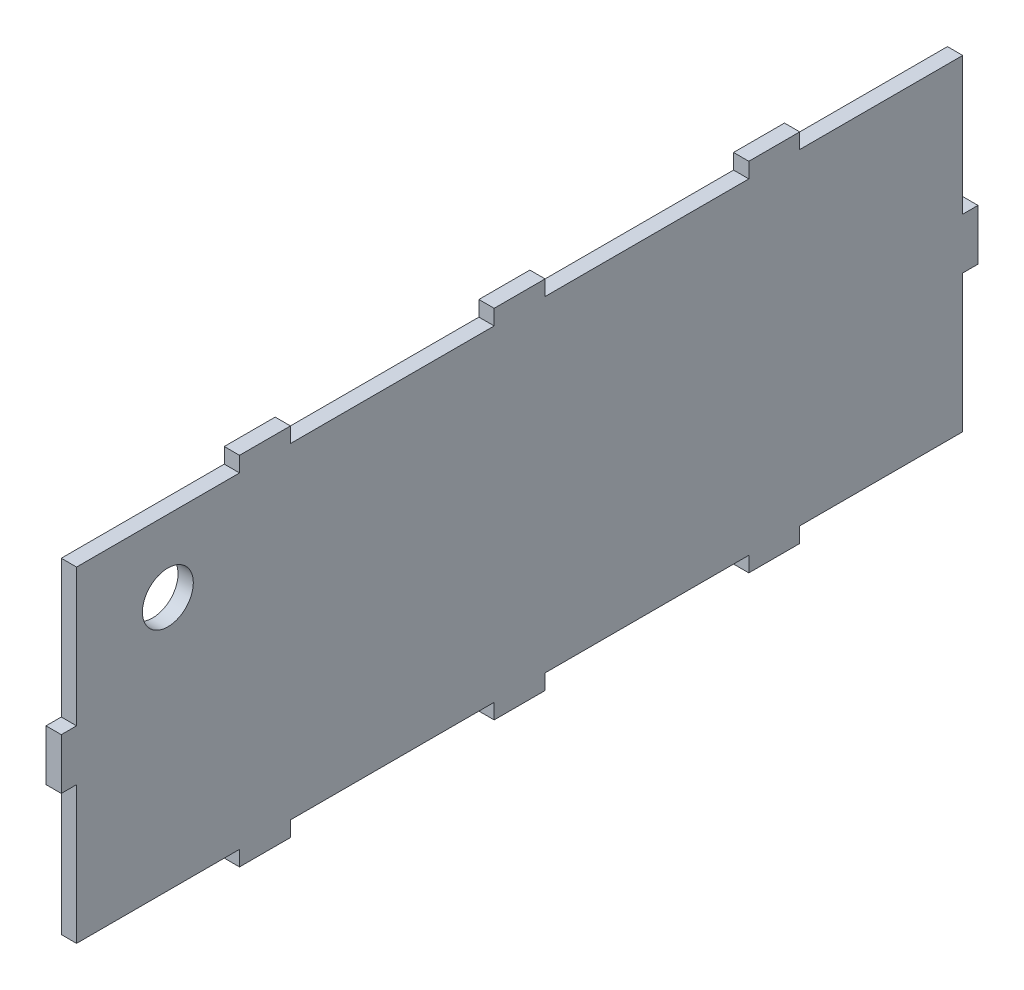
ISO-10303-21;
HEADER;
FILE_DESCRIPTION(('STEP AP214'),'2;1');
FILE_NAME('part.step','',(''),(''),'','','');
FILE_SCHEMA(('AUTOMOTIVE_DESIGN { 1 0 10303 214 1 1 1 1 }'));
ENDSEC;
DATA;
#1=APPLICATION_CONTEXT('core data for automotive mechanical design processes');
#2=APPLICATION_PROTOCOL_DEFINITION('international standard','automotive_design',2000,#1);
#3=PRODUCT_CONTEXT('',#1,'mechanical');
#4=PRODUCT('Part','Part','',(#3));
#5=PRODUCT_RELATED_PRODUCT_CATEGORY('part','',(#4));
#6=PRODUCT_DEFINITION_FORMATION('','',#4);
#7=PRODUCT_DEFINITION_CONTEXT('part definition',#1,'design');
#8=PRODUCT_DEFINITION('design','',#6,#7);
#9=PRODUCT_DEFINITION_SHAPE('','',#8);
#10=(LENGTH_UNIT() NAMED_UNIT(*) SI_UNIT(.MILLI.,.METRE.));
#11=(NAMED_UNIT(*) PLANE_ANGLE_UNIT() SI_UNIT($,.RADIAN.));
#12=(NAMED_UNIT(*) SI_UNIT($,.STERADIAN.) SOLID_ANGLE_UNIT());
#13=UNCERTAINTY_MEASURE_WITH_UNIT(LENGTH_MEASURE(1.E-05),#10,'distance_accuracy_value','');
#14=(GEOMETRIC_REPRESENTATION_CONTEXT(3) GLOBAL_UNCERTAINTY_ASSIGNED_CONTEXT((#13)) GLOBAL_UNIT_ASSIGNED_CONTEXT((#10,
#11,#12)) REPRESENTATION_CONTEXT('',''));
#15=CARTESIAN_POINT('',(0.,0.,0.));
#16=DIRECTION('',(0.,0.,1.));
#17=DIRECTION('',(1.,0.,0.));
#18=AXIS2_PLACEMENT_3D('',#15,#16,#17);
#19=CARTESIAN_POINT('',(3.,35.,-90.));
#20=DIRECTION('',(0.,0.,1.));
#21=DIRECTION('',(0.,-1.,0.));
#22=AXIS2_PLACEMENT_3D('',#19,#20,#21);
#23=PLANE('',#22);
#24=DIRECTION('',(1.,0.,0.));
#25=VECTOR('',#24,1.);
#26=CARTESIAN_POINT('',(-7.,5.,-90.));
#27=LINE('',#26,#25);
#28=CARTESIAN_POINT('',(0.,5.,-90.));
#29=VERTEX_POINT('',#28);
#30=CARTESIAN_POINT('',(3.,5.,-90.));
#31=VERTEX_POINT('',#30);
#32=EDGE_CURVE('E343',#29,#31,#27,.T.);
#33=ORIENTED_EDGE('',*,*,#32,.T.);
#34=DIRECTION('',(0.,1.,0.));
#35=VECTOR('',#34,1.);
#36=CARTESIAN_POINT('',(3.,35.,-90.));
#37=LINE('',#36,#35);
#38=CARTESIAN_POINT('',(3.,-5.,-90.));
#39=VERTEX_POINT('',#38);
#40=EDGE_CURVE('E450',#39,#31,#37,.T.);
#41=ORIENTED_EDGE('',*,*,#40,.F.);
#42=DIRECTION('',(1.,0.,0.));
#43=VECTOR('',#42,1.);
#44=CARTESIAN_POINT('',(-7.,-5.,-90.));
#45=LINE('',#44,#43);
#46=CARTESIAN_POINT('',(0.,-5.,-90.));
#47=VERTEX_POINT('',#46);
#48=EDGE_CURVE('E444',#47,#39,#45,.T.);
#49=ORIENTED_EDGE('',*,*,#48,.F.);
#50=DIRECTION('',(0.,1.,0.));
#51=VECTOR('',#50,1.);
#52=CARTESIAN_POINT('',(0.,35.,-90.));
#53=LINE('',#52,#51);
#54=EDGE_CURVE('E441',#47,#29,#53,.T.);
#55=ORIENTED_EDGE('',*,*,#54,.T.);
#56=EDGE_LOOP('',(#33,#41,#49,#55));
#57=FACE_BOUND('',#56,.T.);
#58=ADVANCED_FACE('F39',(#57),#23,.F.);
#59=CARTESIAN_POINT('',(3.,35.,90.));
#60=DIRECTION('',(0.,-1.,0.));
#61=DIRECTION('',(0.,0.,-1.));
#62=AXIS2_PLACEMENT_3D('',#59,#60,#61);
#63=PLANE('',#62);
#64=DIRECTION('',(1.,0.,0.));
#65=VECTOR('',#64,1.);
#66=CARTESIAN_POINT('',(-7.,35.,55.));
#67=LINE('',#66,#65);
#68=CARTESIAN_POINT('',(0.,35.,55.));
#69=VERTEX_POINT('',#68);
#70=CARTESIAN_POINT('',(3.,35.,55.));
#71=VERTEX_POINT('',#70);
#72=EDGE_CURVE('E419',#69,#71,#67,.T.);
#73=ORIENTED_EDGE('',*,*,#72,.T.);
#74=DIRECTION('',(0.,0.,1.));
#75=VECTOR('',#74,1.);
#76=CARTESIAN_POINT('',(3.,35.,90.));
#77=LINE('',#76,#75);
#78=CARTESIAN_POINT('',(3.,35.,45.));
#79=VERTEX_POINT('',#78);
#80=EDGE_CURVE('E453',#79,#71,#77,.T.);
#81=ORIENTED_EDGE('',*,*,#80,.F.);
#82=DIRECTION('',(1.,0.,0.));
#83=VECTOR('',#82,1.);
#84=CARTESIAN_POINT('',(-7.,35.,45.));
#85=LINE('',#84,#83);
#86=CARTESIAN_POINT('',(0.,35.,45.));
#87=VERTEX_POINT('',#86);
#88=EDGE_CURVE('E306',#87,#79,#85,.T.);
#89=ORIENTED_EDGE('',*,*,#88,.F.);
#90=DIRECTION('',(0.,0.,1.));
#91=VECTOR('',#90,1.);
#92=CARTESIAN_POINT('',(0.,35.,90.));
#93=LINE('',#92,#91);
#94=EDGE_CURVE('E468',#87,#69,#93,.T.);
#95=ORIENTED_EDGE('',*,*,#94,.T.);
#96=EDGE_LOOP('',(#73,#81,#89,#95));
#97=FACE_BOUND('',#96,.T.);
#98=ADVANCED_FACE('F617',(#97),#63,.F.);
#99=DIRECTION('',(1.,0.,0.));
#100=VECTOR('',#99,1.);
#101=CARTESIAN_POINT('',(-7.,35.,5.));
#102=LINE('',#101,#100);
#103=CARTESIAN_POINT('',(0.,35.,5.00000000000003));
#104=VERTEX_POINT('',#103);
#105=CARTESIAN_POINT('',(3.,35.,5.));
#106=VERTEX_POINT('',#105);
#107=EDGE_CURVE('E281',#104,#106,#102,.T.);
#108=ORIENTED_EDGE('',*,*,#107,.T.);
#109=CARTESIAN_POINT('',(3.,35.,-5.));
#110=VERTEX_POINT('',#109);
#111=EDGE_CURVE('E299',#110,#106,#77,.T.);
#112=ORIENTED_EDGE('',*,*,#111,.F.);
#113=DIRECTION('',(1.,0.,0.));
#114=VECTOR('',#113,1.);
#115=CARTESIAN_POINT('',(-7.,35.,-5.));
#116=LINE('',#115,#114);
#117=CARTESIAN_POINT('',(0.,35.,-5.));
#118=VERTEX_POINT('',#117);
#119=EDGE_CURVE('E321',#118,#110,#116,.T.);
#120=ORIENTED_EDGE('',*,*,#119,.F.);
#121=EDGE_CURVE('E471',#118,#104,#93,.T.);
#122=ORIENTED_EDGE('',*,*,#121,.T.);
#123=EDGE_LOOP('',(#108,#112,#120,#122));
#124=FACE_BOUND('',#123,.T.);
#125=ADVANCED_FACE('F625',(#124),#63,.F.);
#126=DIRECTION('',(1.,0.,0.));
#127=VECTOR('',#126,1.);
#128=CARTESIAN_POINT('',(-7.,35.,-45.));
#129=LINE('',#128,#127);
#130=CARTESIAN_POINT('',(0.,35.,-44.9999999999999));
#131=VERTEX_POINT('',#130);
#132=CARTESIAN_POINT('',(3.,35.,-45.));
#133=VERTEX_POINT('',#132);
#134=EDGE_CURVE('E323',#131,#133,#129,.T.);
#135=ORIENTED_EDGE('',*,*,#134,.T.);
#136=CARTESIAN_POINT('',(3.,35.,-55.));
#137=VERTEX_POINT('',#136);
#138=EDGE_CURVE('E457',#137,#133,#77,.T.);
#139=ORIENTED_EDGE('',*,*,#138,.F.);
#140=DIRECTION('',(1.,0.,0.));
#141=VECTOR('',#140,1.);
#142=CARTESIAN_POINT('',(-7.,35.,-55.));
#143=LINE('',#142,#141);
#144=CARTESIAN_POINT('',(0.,35.,-55.));
#145=VERTEX_POINT('',#144);
#146=EDGE_CURVE('E341',#145,#137,#143,.T.);
#147=ORIENTED_EDGE('',*,*,#146,.F.);
#148=EDGE_CURVE('E472',#145,#131,#93,.T.);
#149=ORIENTED_EDGE('',*,*,#148,.T.);
#150=EDGE_LOOP('',(#135,#139,#147,#149));
#151=FACE_BOUND('',#150,.T.);
#152=ADVANCED_FACE('F630',(#151),#63,.F.);
#153=CARTESIAN_POINT('',(3.,35.,90.));
#154=DIRECTION('',(0.,0.,-1.));
#155=DIRECTION('',(0.,1.,0.));
#156=AXIS2_PLACEMENT_3D('',#153,#154,#155);
#157=PLANE('',#156);
#158=DIRECTION('',(1.,0.,0.));
#159=VECTOR('',#158,1.);
#160=CARTESIAN_POINT('',(-7.,-5.,90.));
#161=LINE('',#160,#159);
#162=CARTESIAN_POINT('',(0.,-5.,90.));
#163=VERTEX_POINT('',#162);
#164=CARTESIAN_POINT('',(3.,-5.,90.));
#165=VERTEX_POINT('',#164);
#166=EDGE_CURVE('E398',#163,#165,#161,.T.);
#167=ORIENTED_EDGE('',*,*,#166,.T.);
#168=DIRECTION('',(0.,-1.,0.));
#169=VECTOR('',#168,1.);
#170=CARTESIAN_POINT('',(3.,35.,90.));
#171=LINE('',#170,#169);
#172=CARTESIAN_POINT('',(3.,5.,90.));
#173=VERTEX_POINT('',#172);
#174=EDGE_CURVE('E458',#173,#165,#171,.T.);
#175=ORIENTED_EDGE('',*,*,#174,.F.);
#176=DIRECTION('',(1.,0.,0.));
#177=VECTOR('',#176,1.);
#178=CARTESIAN_POINT('',(-7.,5.,90.));
#179=LINE('',#178,#177);
#180=CARTESIAN_POINT('',(0.,5.,90.));
#181=VERTEX_POINT('',#180);
#182=EDGE_CURVE('E387',#181,#173,#179,.T.);
#183=ORIENTED_EDGE('',*,*,#182,.F.);
#184=DIRECTION('',(0.,-1.,0.));
#185=VECTOR('',#184,1.);
#186=CARTESIAN_POINT('',(0.,35.,90.));
#187=LINE('',#186,#185);
#188=EDGE_CURVE('E473',#181,#163,#187,.T.);
#189=ORIENTED_EDGE('',*,*,#188,.T.);
#190=EDGE_LOOP('',(#167,#175,#183,#189));
#191=FACE_BOUND('',#190,.T.);
#192=ADVANCED_FACE('F597',(#191),#157,.F.);
#193=CARTESIAN_POINT('',(3.,-35.,90.));
#194=DIRECTION('',(0.,1.,0.));
#195=DIRECTION('',(0.,0.,1.));
#196=AXIS2_PLACEMENT_3D('',#193,#194,#195);
#197=PLANE('',#196);
#198=DIRECTION('',(1.,0.,0.));
#199=VECTOR('',#198,1.);
#200=CARTESIAN_POINT('',(-7.,-35.,-5.));
#201=LINE('',#200,#199);
#202=CARTESIAN_POINT('',(0.,-35.,-5.));
#203=VERTEX_POINT('',#202);
#204=CARTESIAN_POINT('',(3.,-35.,-5.));
#205=VERTEX_POINT('',#204);
#206=EDGE_CURVE('E362',#203,#205,#201,.T.);
#207=ORIENTED_EDGE('',*,*,#206,.T.);
#208=DIRECTION('',(0.,0.,-1.));
#209=VECTOR('',#208,1.);
#210=CARTESIAN_POINT('',(3.,-35.,90.));
#211=LINE('',#210,#209);
#212=CARTESIAN_POINT('',(3.,-35.,5.));
#213=VERTEX_POINT('',#212);
#214=EDGE_CURVE('E464',#213,#205,#211,.T.);
#215=ORIENTED_EDGE('',*,*,#214,.F.);
#216=DIRECTION('',(1.,0.,0.));
#217=VECTOR('',#216,1.);
#218=CARTESIAN_POINT('',(-7.,-35.,5.));
#219=LINE('',#218,#217);
#220=CARTESIAN_POINT('',(0.,-35.,5.));
#221=VERTEX_POINT('',#220);
#222=EDGE_CURVE('E353',#221,#213,#219,.T.);
#223=ORIENTED_EDGE('',*,*,#222,.F.);
#224=DIRECTION('',(0.,0.,-1.));
#225=VECTOR('',#224,1.);
#226=CARTESIAN_POINT('',(0.,-35.,90.));
#227=LINE('',#226,#225);
#228=EDGE_CURVE('E479',#221,#203,#227,.T.);
#229=ORIENTED_EDGE('',*,*,#228,.T.);
#230=EDGE_LOOP('',(#207,#215,#223,#229));
#231=FACE_BOUND('',#230,.T.);
#232=ADVANCED_FACE('F566',(#231),#197,.F.);
#233=DIRECTION('',(1.,0.,0.));
#234=VECTOR('',#233,1.);
#235=CARTESIAN_POINT('',(-7.,-35.,45.));
#236=LINE('',#235,#234);
#237=CARTESIAN_POINT('',(0.,-35.,45.));
#238=VERTEX_POINT('',#237);
#239=CARTESIAN_POINT('',(3.,-35.,45.));
#240=VERTEX_POINT('',#239);
#241=EDGE_CURVE('E378',#238,#240,#236,.T.);
#242=ORIENTED_EDGE('',*,*,#241,.T.);
#243=CARTESIAN_POINT('',(3.,-35.,55.));
#244=VERTEX_POINT('',#243);
#245=EDGE_CURVE('E465',#244,#240,#211,.T.);
#246=ORIENTED_EDGE('',*,*,#245,.F.);
#247=DIRECTION('',(1.,0.,0.));
#248=VECTOR('',#247,1.);
#249=CARTESIAN_POINT('',(-7.,-35.,55.));
#250=LINE('',#249,#248);
#251=CARTESIAN_POINT('',(0.,-35.,55.));
#252=VERTEX_POINT('',#251);
#253=EDGE_CURVE('E371',#252,#244,#250,.T.);
#254=ORIENTED_EDGE('',*,*,#253,.F.);
#255=EDGE_CURVE('E454',#252,#238,#227,.T.);
#256=ORIENTED_EDGE('',*,*,#255,.T.);
#257=EDGE_LOOP('',(#242,#246,#254,#256));
#258=FACE_BOUND('',#257,.T.);
#259=ADVANCED_FACE('F572',(#258),#197,.F.);
#260=CARTESIAN_POINT('',(3.,-35.,-45.));
#261=VERTEX_POINT('',#260);
#262=CARTESIAN_POINT('',(3.,-35.,-55.));
#263=VERTEX_POINT('',#262);
#264=EDGE_CURVE('E461',#261,#263,#211,.T.);
#265=ORIENTED_EDGE('',*,*,#264,.F.);
#266=DIRECTION('',(1.,0.,0.));
#267=VECTOR('',#266,1.);
#268=CARTESIAN_POINT('',(-7.,-35.,-45.));
#269=LINE('',#268,#267);
#270=CARTESIAN_POINT('',(0.,-35.,-45.));
#271=VERTEX_POINT('',#270);
#272=EDGE_CURVE('E359',#271,#261,#269,.T.);
#273=ORIENTED_EDGE('',*,*,#272,.F.);
#274=CARTESIAN_POINT('',(0.,-35.,-54.9999999999999));
#275=VERTEX_POINT('',#274);
#276=EDGE_CURVE('E476',#271,#275,#227,.T.);
#277=ORIENTED_EDGE('',*,*,#276,.T.);
#278=DIRECTION('',(1.,0.,0.));
#279=VECTOR('',#278,1.);
#280=CARTESIAN_POINT('',(-7.,-35.,-55.));
#281=LINE('',#280,#279);
#282=EDGE_CURVE('E446',#275,#263,#281,.T.);
#283=ORIENTED_EDGE('',*,*,#282,.T.);
#284=EDGE_LOOP('',(#265,#273,#277,#283));
#285=FACE_BOUND('',#284,.T.);
#286=ADVANCED_FACE('F678',(#285),#197,.F.);
#287=CARTESIAN_POINT('',(3.,0.,0.));
#288=DIRECTION('',(1.,0.,0.));
#289=DIRECTION('',(0.,0.,-1.));
#290=AXIS2_PLACEMENT_3D('',#287,#288,#289);
#291=PLANE('',#290);
#292=CARTESIAN_POINT('',(3.,17.8731853963098,69.0724143961554));
#293=DIRECTION('',(1.,0.,0.));
#294=DIRECTION('',(0.,0.,-1.));
#295=AXIS2_PLACEMENT_3D('',#292,#293,#294);
#296=CIRCLE('',#295,5.);
#297=CARTESIAN_POINT('',(3.,17.8731853963098,64.0724143961554));
#298=VERTEX_POINT('',#297);
#299=EDGE_CURVE('E1057',#298,#298,#296,.T.);
#300=ORIENTED_EDGE('',*,*,#299,.F.);
#301=EDGE_LOOP('',(#300));
#302=FACE_BOUND('',#301,.T.);
#303=DIRECTION('',(0.,1.,0.));
#304=VECTOR('',#303,1.);
#305=CARTESIAN_POINT('',(3.,0.,-45.));
#306=LINE('',#305,#304);
#307=CARTESIAN_POINT('',(3.,-32.,-45.));
#308=VERTEX_POINT('',#307);
#309=EDGE_CURVE('E349',#261,#308,#306,.T.);
#310=ORIENTED_EDGE('',*,*,#309,.F.);
#311=ORIENTED_EDGE('',*,*,#264,.T.);
#312=DIRECTION('',(0.,1.,0.));
#313=VECTOR('',#312,1.);
#314=CARTESIAN_POINT('',(3.,0.,-55.));
#315=LINE('',#314,#313);
#316=CARTESIAN_POINT('',(3.,-32.,-55.));
#317=VERTEX_POINT('',#316);
#318=EDGE_CURVE('E429',#263,#317,#315,.T.);
#319=ORIENTED_EDGE('',*,*,#318,.T.);
#320=DIRECTION('',(0.,0.,1.));
#321=VECTOR('',#320,1.);
#322=CARTESIAN_POINT('',(3.,-32.,0.));
#323=LINE('',#322,#321);
#324=CARTESIAN_POINT('',(3.,-32.,-87.));
#325=VERTEX_POINT('',#324);
#326=EDGE_CURVE('E361',#325,#317,#323,.T.);
#327=ORIENTED_EDGE('',*,*,#326,.F.);
#328=DIRECTION('',(0.,-1.,0.));
#329=VECTOR('',#328,1.);
#330=CARTESIAN_POINT('',(3.,0.,-87.));
#331=LINE('',#330,#329);
#332=CARTESIAN_POINT('',(3.,-5.,-87.));
#333=VERTEX_POINT('',#332);
#334=EDGE_CURVE('E435',#333,#325,#331,.T.);
#335=ORIENTED_EDGE('',*,*,#334,.F.);
#336=DIRECTION('',(0.,0.,-1.));
#337=VECTOR('',#336,1.);
#338=CARTESIAN_POINT('',(3.,-5.,0.));
#339=LINE('',#338,#337);
#340=EDGE_CURVE('E432',#333,#39,#339,.T.);
#341=ORIENTED_EDGE('',*,*,#340,.T.);
#342=ORIENTED_EDGE('',*,*,#40,.T.);
#343=DIRECTION('',(0.,0.,1.));
#344=VECTOR('',#343,1.);
#345=CARTESIAN_POINT('',(3.,4.99999999999998,0.));
#346=LINE('',#345,#344);
#347=CARTESIAN_POINT('',(3.,5.,-87.));
#348=VERTEX_POINT('',#347);
#349=EDGE_CURVE('E333',#31,#348,#346,.T.);
#350=ORIENTED_EDGE('',*,*,#349,.T.);
#351=DIRECTION('',(0.,-1.,0.));
#352=VECTOR('',#351,1.);
#353=CARTESIAN_POINT('',(3.,0.,-87.));
#354=LINE('',#353,#352);
#355=CARTESIAN_POINT('',(3.,32.,-87.));
#356=VERTEX_POINT('',#355);
#357=EDGE_CURVE('E330',#356,#348,#354,.T.);
#358=ORIENTED_EDGE('',*,*,#357,.F.);
#359=DIRECTION('',(0.,0.,1.));
#360=VECTOR('',#359,1.);
#361=CARTESIAN_POINT('',(3.,32.,0.));
#362=LINE('',#361,#360);
#363=CARTESIAN_POINT('',(3.,32.,-55.));
#364=VERTEX_POINT('',#363);
#365=EDGE_CURVE('E327',#356,#364,#362,.T.);
#366=ORIENTED_EDGE('',*,*,#365,.T.);
#367=DIRECTION('',(0.,-1.,0.));
#368=VECTOR('',#367,1.);
#369=CARTESIAN_POINT('',(3.,0.,-55.));
#370=LINE('',#369,#368);
#371=EDGE_CURVE('E336',#137,#364,#370,.T.);
#372=ORIENTED_EDGE('',*,*,#371,.F.);
#373=ORIENTED_EDGE('',*,*,#138,.T.);
#374=DIRECTION('',(0.,-1.,0.));
#375=VECTOR('',#374,1.);
#376=CARTESIAN_POINT('',(3.,0.,-45.));
#377=LINE('',#376,#375);
#378=CARTESIAN_POINT('',(3.,32.,-45.));
#379=VERTEX_POINT('',#378);
#380=EDGE_CURVE('E312',#133,#379,#377,.T.);
#381=ORIENTED_EDGE('',*,*,#380,.T.);
#382=DIRECTION('',(0.,0.,1.));
#383=VECTOR('',#382,1.);
#384=CARTESIAN_POINT('',(3.,32.,0.));
#385=LINE('',#384,#383);
#386=CARTESIAN_POINT('',(3.,32.,-5.));
#387=VERTEX_POINT('',#386);
#388=EDGE_CURVE('E309',#379,#387,#385,.T.);
#389=ORIENTED_EDGE('',*,*,#388,.T.);
#390=DIRECTION('',(0.,-1.,0.));
#391=VECTOR('',#390,1.);
#392=CARTESIAN_POINT('',(3.,0.,-5.));
#393=LINE('',#392,#391);
#394=EDGE_CURVE('E316',#110,#387,#393,.T.);
#395=ORIENTED_EDGE('',*,*,#394,.F.);
#396=ORIENTED_EDGE('',*,*,#111,.T.);
#397=DIRECTION('',(0.,-1.,0.));
#398=VECTOR('',#397,1.);
#399=CARTESIAN_POINT('',(3.,0.,4.99999999999999));
#400=LINE('',#399,#398);
#401=CARTESIAN_POINT('',(3.,32.,5.));
#402=VERTEX_POINT('',#401);
#403=EDGE_CURVE('E275',#106,#402,#400,.T.);
#404=ORIENTED_EDGE('',*,*,#403,.T.);
#405=DIRECTION('',(0.,0.,1.));
#406=VECTOR('',#405,1.);
#407=CARTESIAN_POINT('',(3.,32.,0.));
#408=LINE('',#407,#406);
#409=CARTESIAN_POINT('',(3.,32.,45.));
#410=VERTEX_POINT('',#409);
#411=EDGE_CURVE('E285',#402,#410,#408,.T.);
#412=ORIENTED_EDGE('',*,*,#411,.T.);
#413=DIRECTION('',(0.,-1.,0.));
#414=VECTOR('',#413,1.);
#415=CARTESIAN_POINT('',(3.,0.,45.));
#416=LINE('',#415,#414);
#417=EDGE_CURVE('E282',#79,#410,#416,.T.);
#418=ORIENTED_EDGE('',*,*,#417,.F.);
#419=ORIENTED_EDGE('',*,*,#80,.T.);
#420=DIRECTION('',(0.,-1.,0.));
#421=VECTOR('',#420,1.);
#422=CARTESIAN_POINT('',(3.,-1.27213054904966E-13,54.9999999999999));
#423=LINE('',#422,#421);
#424=CARTESIAN_POINT('',(3.,32.,55.));
#425=VERTEX_POINT('',#424);
#426=EDGE_CURVE('E414',#71,#425,#423,.T.);
#427=ORIENTED_EDGE('',*,*,#426,.T.);
#428=DIRECTION('',(0.,0.,1.));
#429=VECTOR('',#428,1.);
#430=CARTESIAN_POINT('',(3.,32.,0.));
#431=LINE('',#430,#429);
#432=CARTESIAN_POINT('',(3.,32.,87.));
#433=VERTEX_POINT('',#432);
#434=EDGE_CURVE('E411',#425,#433,#431,.T.);
#435=ORIENTED_EDGE('',*,*,#434,.T.);
#436=DIRECTION('',(0.,1.,0.));
#437=VECTOR('',#436,1.);
#438=CARTESIAN_POINT('',(3.,0.,87.));
#439=LINE('',#438,#437);
#440=CARTESIAN_POINT('',(3.,5.,87.));
#441=VERTEX_POINT('',#440);
#442=EDGE_CURVE('E408',#441,#433,#439,.T.);
#443=ORIENTED_EDGE('',*,*,#442,.F.);
#444=DIRECTION('',(0.,0.,-1.));
#445=VECTOR('',#444,1.);
#446=CARTESIAN_POINT('',(3.,5.,0.));
#447=LINE('',#446,#445);
#448=EDGE_CURVE('E305',#173,#441,#447,.T.);
#449=ORIENTED_EDGE('',*,*,#448,.F.);
#450=ORIENTED_EDGE('',*,*,#174,.T.);
#451=DIRECTION('',(0.,0.,-1.));
#452=VECTOR('',#451,1.);
#453=CARTESIAN_POINT('',(3.,-5.,0.));
#454=LINE('',#453,#452);
#455=CARTESIAN_POINT('',(3.,-5.,87.));
#456=VERTEX_POINT('',#455);
#457=EDGE_CURVE('E393',#165,#456,#454,.T.);
#458=ORIENTED_EDGE('',*,*,#457,.T.);
#459=DIRECTION('',(0.,-1.,0.));
#460=VECTOR('',#459,1.);
#461=CARTESIAN_POINT('',(3.,0.,87.));
#462=LINE('',#461,#460);
#463=CARTESIAN_POINT('',(3.,-32.,87.));
#464=VERTEX_POINT('',#463);
#465=EDGE_CURVE('E390',#456,#464,#462,.T.);
#466=ORIENTED_EDGE('',*,*,#465,.T.);
#467=DIRECTION('',(0.,0.,1.));
#468=VECTOR('',#467,1.);
#469=CARTESIAN_POINT('',(3.,-32.,0.));
#470=LINE('',#469,#468);
#471=CARTESIAN_POINT('',(3.,-32.,55.));
#472=VERTEX_POINT('',#471);
#473=EDGE_CURVE('E386',#472,#464,#470,.T.);
#474=ORIENTED_EDGE('',*,*,#473,.F.);
#475=DIRECTION('',(0.,1.,0.));
#476=VECTOR('',#475,1.);
#477=CARTESIAN_POINT('',(3.,0.,55.));
#478=LINE('',#477,#476);
#479=EDGE_CURVE('E383',#244,#472,#478,.T.);
#480=ORIENTED_EDGE('',*,*,#479,.F.);
#481=ORIENTED_EDGE('',*,*,#245,.T.);
#482=DIRECTION('',(0.,1.,0.));
#483=VECTOR('',#482,1.);
#484=CARTESIAN_POINT('',(3.,0.,45.));
#485=LINE('',#484,#483);
#486=CARTESIAN_POINT('',(3.,-32.,45.));
#487=VERTEX_POINT('',#486);
#488=EDGE_CURVE('E373',#240,#487,#485,.T.);
#489=ORIENTED_EDGE('',*,*,#488,.T.);
#490=DIRECTION('',(0.,0.,1.));
#491=VECTOR('',#490,1.);
#492=CARTESIAN_POINT('',(3.,-32.,0.));
#493=LINE('',#492,#491);
#494=CARTESIAN_POINT('',(3.,-32.,5.));
#495=VERTEX_POINT('',#494);
#496=EDGE_CURVE('E370',#495,#487,#493,.T.);
#497=ORIENTED_EDGE('',*,*,#496,.F.);
#498=DIRECTION('',(0.,1.,0.));
#499=VECTOR('',#498,1.);
#500=CARTESIAN_POINT('',(3.,0.,5.));
#501=LINE('',#500,#499);
#502=EDGE_CURVE('E367',#213,#495,#501,.T.);
#503=ORIENTED_EDGE('',*,*,#502,.F.);
#504=ORIENTED_EDGE('',*,*,#214,.T.);
#505=DIRECTION('',(0.,1.,0.));
#506=VECTOR('',#505,1.);
#507=CARTESIAN_POINT('',(3.,0.,-5.00000000000032));
#508=LINE('',#507,#506);
#509=CARTESIAN_POINT('',(3.,-32.,-5.00000000000003));
#510=VERTEX_POINT('',#509);
#511=EDGE_CURVE('E355',#205,#510,#508,.T.);
#512=ORIENTED_EDGE('',*,*,#511,.T.);
#513=DIRECTION('',(0.,0.,1.));
#514=VECTOR('',#513,1.);
#515=CARTESIAN_POINT('',(3.,-32.,0.));
#516=LINE('',#515,#514);
#517=EDGE_CURVE('E352',#308,#510,#516,.T.);
#518=ORIENTED_EDGE('',*,*,#517,.F.);
#519=EDGE_LOOP('',(#310,#311,#319,#327,#335,#341,#342,#350,#358,#366,#372,#373,#381,#389,#395,
#396,#404,#412,#418,#419,#427,#435,#443,#449,#450,#458,#466,#474,#480,#481,#489,#497,#503,#504,
#512,#518));
#520=FACE_BOUND('',#519,.T.);
#521=ADVANCED_FACE('F296',(#302,#520),#291,.T.);
#522=CARTESIAN_POINT('',(0.,0.,0.));
#523=DIRECTION('',(1.,0.,0.));
#524=DIRECTION('',(0.,0.,-1.));
#525=AXIS2_PLACEMENT_3D('',#522,#523,#524);
#526=PLANE('',#525);
#527=CARTESIAN_POINT('',(0.,17.8731853963098,69.0724143961554));
#528=DIRECTION('',(1.,0.,0.));
#529=DIRECTION('',(0.,0.,-1.));
#530=AXIS2_PLACEMENT_3D('',#527,#528,#529);
#531=CIRCLE('',#530,5.);
#532=CARTESIAN_POINT('',(0.,17.8731853963098,64.0724143961554));
#533=VERTEX_POINT('',#532);
#534=EDGE_CURVE('E42',#533,#533,#531,.T.);
#535=ORIENTED_EDGE('',*,*,#534,.T.);
#536=EDGE_LOOP('',(#535));
#537=FACE_BOUND('',#536,.T.);
#538=ORIENTED_EDGE('',*,*,#276,.F.);
#539=DIRECTION('',(0.,1.,0.));
#540=VECTOR('',#539,1.);
#541=CARTESIAN_POINT('',(0.,0.,-45.));
#542=LINE('',#541,#540);
#543=CARTESIAN_POINT('',(0.,-32.,-45.));
#544=VERTEX_POINT('',#543);
#545=EDGE_CURVE('E11',#271,#544,#542,.T.);
#546=ORIENTED_EDGE('',*,*,#545,.T.);
#547=DIRECTION('',(0.,0.,1.));
#548=VECTOR('',#547,1.);
#549=CARTESIAN_POINT('',(0.,-32.,0.));
#550=LINE('',#549,#548);
#551=CARTESIAN_POINT('',(0.,-32.,-5.00000000000003));
#552=VERTEX_POINT('',#551);
#553=EDGE_CURVE('E544',#544,#552,#550,.T.);
#554=ORIENTED_EDGE('',*,*,#553,.T.);
#555=DIRECTION('',(0.,1.,0.));
#556=VECTOR('',#555,1.);
#557=CARTESIAN_POINT('',(0.,0.,-5.00000000000032));
#558=LINE('',#557,#556);
#559=EDGE_CURVE('E47',#203,#552,#558,.T.);
#560=ORIENTED_EDGE('',*,*,#559,.F.);
#561=ORIENTED_EDGE('',*,*,#228,.F.);
#562=DIRECTION('',(0.,1.,0.));
#563=VECTOR('',#562,1.);
#564=CARTESIAN_POINT('',(0.,0.,5.));
#565=LINE('',#564,#563);
#566=CARTESIAN_POINT('',(0.,-32.,5.));
#567=VERTEX_POINT('',#566);
#568=EDGE_CURVE('E541',#221,#567,#565,.T.);
#569=ORIENTED_EDGE('',*,*,#568,.T.);
#570=DIRECTION('',(0.,0.,1.));
#571=VECTOR('',#570,1.);
#572=CARTESIAN_POINT('',(0.,-32.,0.));
#573=LINE('',#572,#571);
#574=CARTESIAN_POINT('',(0.,-32.,45.));
#575=VERTEX_POINT('',#574);
#576=EDGE_CURVE('E536',#567,#575,#573,.T.);
#577=ORIENTED_EDGE('',*,*,#576,.T.);
#578=DIRECTION('',(0.,1.,0.));
#579=VECTOR('',#578,1.);
#580=CARTESIAN_POINT('',(0.,0.,45.));
#581=LINE('',#580,#579);
#582=EDGE_CURVE('E539',#238,#575,#581,.T.);
#583=ORIENTED_EDGE('',*,*,#582,.F.);
#584=ORIENTED_EDGE('',*,*,#255,.F.);
#585=DIRECTION('',(0.,1.,0.));
#586=VECTOR('',#585,1.);
#587=CARTESIAN_POINT('',(0.,0.,55.));
#588=LINE('',#587,#586);
#589=CARTESIAN_POINT('',(0.,-32.,55.));
#590=VERTEX_POINT('',#589);
#591=EDGE_CURVE('E533',#252,#590,#588,.T.);
#592=ORIENTED_EDGE('',*,*,#591,.T.);
#593=DIRECTION('',(0.,0.,1.));
#594=VECTOR('',#593,1.);
#595=CARTESIAN_POINT('',(0.,-32.,0.));
#596=LINE('',#595,#594);
#597=CARTESIAN_POINT('',(0.,-32.,87.));
#598=VERTEX_POINT('',#597);
#599=EDGE_CURVE('E525',#590,#598,#596,.T.);
#600=ORIENTED_EDGE('',*,*,#599,.T.);
#601=DIRECTION('',(0.,-1.,0.));
#602=VECTOR('',#601,1.);
#603=CARTESIAN_POINT('',(0.,0.,87.));
#604=LINE('',#603,#602);
#605=CARTESIAN_POINT('',(0.,-5.,87.));
#606=VERTEX_POINT('',#605);
#607=EDGE_CURVE('E528',#606,#598,#604,.T.);
#608=ORIENTED_EDGE('',*,*,#607,.F.);
#609=DIRECTION('',(0.,0.,-1.));
#610=VECTOR('',#609,1.);
#611=CARTESIAN_POINT('',(0.,-5.,0.));
#612=LINE('',#611,#610);
#613=EDGE_CURVE('E531',#163,#606,#612,.T.);
#614=ORIENTED_EDGE('',*,*,#613,.F.);
#615=ORIENTED_EDGE('',*,*,#188,.F.);
#616=DIRECTION('',(0.,0.,-1.));
#617=VECTOR('',#616,1.);
#618=CARTESIAN_POINT('',(0.,5.,0.));
#619=LINE('',#618,#617);
#620=CARTESIAN_POINT('',(0.,5.,87.));
#621=VERTEX_POINT('',#620);
#622=EDGE_CURVE('E522',#181,#621,#619,.T.);
#623=ORIENTED_EDGE('',*,*,#622,.T.);
#624=DIRECTION('',(0.,1.,0.));
#625=VECTOR('',#624,1.);
#626=CARTESIAN_POINT('',(0.,0.,87.));
#627=LINE('',#626,#625);
#628=CARTESIAN_POINT('',(0.,32.,87.));
#629=VERTEX_POINT('',#628);
#630=EDGE_CURVE('E514',#621,#629,#627,.T.);
#631=ORIENTED_EDGE('',*,*,#630,.T.);
#632=DIRECTION('',(0.,0.,1.));
#633=VECTOR('',#632,1.);
#634=CARTESIAN_POINT('',(0.,32.,0.));
#635=LINE('',#634,#633);
#636=CARTESIAN_POINT('',(0.,32.,55.));
#637=VERTEX_POINT('',#636);
#638=EDGE_CURVE('E517',#637,#629,#635,.T.);
#639=ORIENTED_EDGE('',*,*,#638,.F.);
#640=DIRECTION('',(0.,-1.,0.));
#641=VECTOR('',#640,1.);
#642=CARTESIAN_POINT('',(0.,-1.27213054904966E-13,54.9999999999999));
#643=LINE('',#642,#641);
#644=EDGE_CURVE('E520',#69,#637,#643,.T.);
#645=ORIENTED_EDGE('',*,*,#644,.F.);
#646=ORIENTED_EDGE('',*,*,#94,.F.);
#647=DIRECTION('',(0.,-1.,0.));
#648=VECTOR('',#647,1.);
#649=CARTESIAN_POINT('',(0.,0.,45.));
#650=LINE('',#649,#648);
#651=CARTESIAN_POINT('',(0.,32.,45.));
#652=VERTEX_POINT('',#651);
#653=EDGE_CURVE('E511',#87,#652,#650,.T.);
#654=ORIENTED_EDGE('',*,*,#653,.T.);
#655=DIRECTION('',(0.,0.,1.));
#656=VECTOR('',#655,1.);
#657=CARTESIAN_POINT('',(0.,32.,0.));
#658=LINE('',#657,#656);
#659=CARTESIAN_POINT('',(0.,32.,5.));
#660=VERTEX_POINT('',#659);
#661=EDGE_CURVE('E509',#660,#652,#658,.T.);
#662=ORIENTED_EDGE('',*,*,#661,.F.);
#663=DIRECTION('',(0.,-1.,0.));
#664=VECTOR('',#663,1.);
#665=CARTESIAN_POINT('',(0.,0.,4.99999999999999));
#666=LINE('',#665,#664);
#667=EDGE_CURVE('E278',#104,#660,#666,.T.);
#668=ORIENTED_EDGE('',*,*,#667,.F.);
#669=ORIENTED_EDGE('',*,*,#121,.F.);
#670=DIRECTION('',(0.,-1.,0.));
#671=VECTOR('',#670,1.);
#672=CARTESIAN_POINT('',(0.,0.,-5.));
#673=LINE('',#672,#671);
#674=CARTESIAN_POINT('',(0.,32.,-5.));
#675=VERTEX_POINT('',#674);
#676=EDGE_CURVE('E505',#118,#675,#673,.T.);
#677=ORIENTED_EDGE('',*,*,#676,.T.);
#678=DIRECTION('',(0.,0.,1.));
#679=VECTOR('',#678,1.);
#680=CARTESIAN_POINT('',(0.,32.,0.));
#681=LINE('',#680,#679);
#682=CARTESIAN_POINT('',(0.,32.,-45.));
#683=VERTEX_POINT('',#682);
#684=EDGE_CURVE('E503',#683,#675,#681,.T.);
#685=ORIENTED_EDGE('',*,*,#684,.F.);
#686=DIRECTION('',(0.,-1.,0.));
#687=VECTOR('',#686,1.);
#688=CARTESIAN_POINT('',(0.,0.,-45.));
#689=LINE('',#688,#687);
#690=EDGE_CURVE('E501',#131,#683,#689,.T.);
#691=ORIENTED_EDGE('',*,*,#690,.F.);
#692=ORIENTED_EDGE('',*,*,#148,.F.);
#693=DIRECTION('',(0.,-1.,0.));
#694=VECTOR('',#693,1.);
#695=CARTESIAN_POINT('',(0.,0.,-55.));
#696=LINE('',#695,#694);
#697=CARTESIAN_POINT('',(0.,32.,-55.));
#698=VERTEX_POINT('',#697);
#699=EDGE_CURVE('E498',#145,#698,#696,.T.);
#700=ORIENTED_EDGE('',*,*,#699,.T.);
#701=DIRECTION('',(0.,0.,1.));
#702=VECTOR('',#701,1.);
#703=CARTESIAN_POINT('',(0.,32.,0.));
#704=LINE('',#703,#702);
#705=CARTESIAN_POINT('',(0.,32.,-87.));
#706=VERTEX_POINT('',#705);
#707=EDGE_CURVE('E496',#706,#698,#704,.T.);
#708=ORIENTED_EDGE('',*,*,#707,.F.);
#709=DIRECTION('',(0.,-1.,0.));
#710=VECTOR('',#709,1.);
#711=CARTESIAN_POINT('',(0.,0.,-87.));
#712=LINE('',#711,#710);
#713=CARTESIAN_POINT('',(0.,5.,-87.));
#714=VERTEX_POINT('',#713);
#715=EDGE_CURVE('E490',#706,#714,#712,.T.);
#716=ORIENTED_EDGE('',*,*,#715,.T.);
#717=DIRECTION('',(0.,0.,1.));
#718=VECTOR('',#717,1.);
#719=CARTESIAN_POINT('',(0.,4.99999999999998,0.));
#720=LINE('',#719,#718);
#721=EDGE_CURVE('E493',#29,#714,#720,.T.);
#722=ORIENTED_EDGE('',*,*,#721,.F.);
#723=ORIENTED_EDGE('',*,*,#54,.F.);
#724=DIRECTION('',(0.,0.,-1.));
#725=VECTOR('',#724,1.);
#726=CARTESIAN_POINT('',(0.,-5.,0.));
#727=LINE('',#726,#725);
#728=CARTESIAN_POINT('',(0.,-5.,-87.));
#729=VERTEX_POINT('',#728);
#730=EDGE_CURVE('E488',#729,#47,#727,.T.);
#731=ORIENTED_EDGE('',*,*,#730,.F.);
#732=DIRECTION('',(0.,-1.,0.));
#733=VECTOR('',#732,1.);
#734=CARTESIAN_POINT('',(0.,0.,-87.));
#735=LINE('',#734,#733);
#736=CARTESIAN_POINT('',(0.,-32.,-87.));
#737=VERTEX_POINT('',#736);
#738=EDGE_CURVE('E485',#729,#737,#735,.T.);
#739=ORIENTED_EDGE('',*,*,#738,.T.);
#740=DIRECTION('',(0.,0.,1.));
#741=VECTOR('',#740,1.);
#742=CARTESIAN_POINT('',(0.,-32.,0.));
#743=LINE('',#742,#741);
#744=CARTESIAN_POINT('',(0.,-32.,-55.));
#745=VERTEX_POINT('',#744);
#746=EDGE_CURVE('E482',#737,#745,#743,.T.);
#747=ORIENTED_EDGE('',*,*,#746,.T.);
#748=DIRECTION('',(0.,1.,0.));
#749=VECTOR('',#748,1.);
#750=CARTESIAN_POINT('',(0.,0.,-55.));
#751=LINE('',#750,#749);
#752=EDGE_CURVE('E480',#275,#745,#751,.T.);
#753=ORIENTED_EDGE('',*,*,#752,.F.);
#754=EDGE_LOOP('',(#538,#546,#554,#560,#561,#569,#577,#583,#584,#592,#600,#608,#614,#615,#623,
#631,#639,#645,#646,#654,#662,#668,#669,#677,#685,#691,#692,#700,#708,#716,#722,#723,#731,#739,
#747,#753));
#755=FACE_BOUND('',#754,.T.);
#756=ADVANCED_FACE('F554',(#537,#755),#526,.F.);
#757=CARTESIAN_POINT('',(-7.,-32.,0.));
#758=DIRECTION('',(0.,1.,0.));
#759=DIRECTION('',(0.,0.,1.));
#760=AXIS2_PLACEMENT_3D('',#757,#758,#759);
#761=PLANE('',#760);
#762=DIRECTION('',(1.,0.,0.));
#763=VECTOR('',#762,1.);
#764=CARTESIAN_POINT('',(-7.,-32.,-87.));
#765=LINE('',#764,#763);
#766=EDGE_CURVE('E439',#737,#325,#765,.T.);
#767=ORIENTED_EDGE('',*,*,#766,.T.);
#768=ORIENTED_EDGE('',*,*,#326,.T.);
#769=DIRECTION('',(1.,0.,0.));
#770=VECTOR('',#769,1.);
#771=CARTESIAN_POINT('',(-7.,-32.,-55.));
#772=LINE('',#771,#770);
#773=EDGE_CURVE('E438',#745,#317,#772,.T.);
#774=ORIENTED_EDGE('',*,*,#773,.F.);
#775=ORIENTED_EDGE('',*,*,#746,.F.);
#776=EDGE_LOOP('',(#767,#768,#774,#775));
#777=FACE_BOUND('',#776,.T.);
#778=ADVANCED_FACE('F673',(#777),#761,.F.);
#779=CARTESIAN_POINT('',(-7.,0.,-87.));
#780=DIRECTION('',(0.,0.,1.));
#781=DIRECTION('',(1.,0.,0.));
#782=AXIS2_PLACEMENT_3D('',#779,#780,#781);
#783=PLANE('',#782);
#784=DIRECTION('',(1.,0.,0.));
#785=VECTOR('',#784,1.);
#786=CARTESIAN_POINT('',(-7.,-5.,-87.));
#787=LINE('',#786,#785);
#788=EDGE_CURVE('E442',#729,#333,#787,.T.);
#789=ORIENTED_EDGE('',*,*,#788,.T.);
#790=ORIENTED_EDGE('',*,*,#334,.T.);
#791=ORIENTED_EDGE('',*,*,#766,.F.);
#792=ORIENTED_EDGE('',*,*,#738,.F.);
#793=EDGE_LOOP('',(#789,#790,#791,#792));
#794=FACE_BOUND('',#793,.T.);
#795=ADVANCED_FACE('F671',(#794),#783,.F.);
#796=CARTESIAN_POINT('',(-7.,-5.,0.));
#797=DIRECTION('',(0.,-1.,0.));
#798=DIRECTION('',(0.,0.,-1.));
#799=AXIS2_PLACEMENT_3D('',#796,#797,#798);
#800=PLANE('',#799);
#801=ORIENTED_EDGE('',*,*,#730,.T.);
#802=ORIENTED_EDGE('',*,*,#48,.T.);
#803=ORIENTED_EDGE('',*,*,#340,.F.);
#804=ORIENTED_EDGE('',*,*,#788,.F.);
#805=EDGE_LOOP('',(#801,#802,#803,#804));
#806=FACE_BOUND('',#805,.T.);
#807=ADVANCED_FACE('F666',(#806),#800,.T.);
#808=CARTESIAN_POINT('',(-7.,0.,-55.));
#809=DIRECTION('',(0.,0.,-1.));
#810=DIRECTION('',(-1.,0.,0.));
#811=AXIS2_PLACEMENT_3D('',#808,#809,#810);
#812=PLANE('',#811);
#813=ORIENTED_EDGE('',*,*,#752,.T.);
#814=ORIENTED_EDGE('',*,*,#773,.T.);
#815=ORIENTED_EDGE('',*,*,#318,.F.);
#816=ORIENTED_EDGE('',*,*,#282,.F.);
#817=EDGE_LOOP('',(#813,#814,#815,#816));
#818=FACE_BOUND('',#817,.T.);
#819=ADVANCED_FACE('F676',(#818),#812,.T.);
#820=CARTESIAN_POINT('',(-7.,32.,0.));
#821=DIRECTION('',(0.,1.,0.));
#822=DIRECTION('',(0.,0.,1.));
#823=AXIS2_PLACEMENT_3D('',#820,#821,#822);
#824=PLANE('',#823);
#825=ORIENTED_EDGE('',*,*,#707,.T.);
#826=DIRECTION('',(1.,0.,0.));
#827=VECTOR('',#826,1.);
#828=CARTESIAN_POINT('',(-7.,32.,-55.));
#829=LINE('',#828,#827);
#830=EDGE_CURVE('E313',#698,#364,#829,.T.);
#831=ORIENTED_EDGE('',*,*,#830,.T.);
#832=ORIENTED_EDGE('',*,*,#365,.F.);
#833=DIRECTION('',(1.,0.,0.));
#834=VECTOR('',#833,1.);
#835=CARTESIAN_POINT('',(-7.,32.,-87.));
#836=LINE('',#835,#834);
#837=EDGE_CURVE('E339',#706,#356,#836,.T.);
#838=ORIENTED_EDGE('',*,*,#837,.F.);
#839=EDGE_LOOP('',(#825,#831,#832,#838));
#840=FACE_BOUND('',#839,.T.);
#841=ADVANCED_FACE('F650',(#840),#824,.T.);
#842=CARTESIAN_POINT('',(-7.,0.,-55.));
#843=DIRECTION('',(0.,0.,1.));
#844=DIRECTION('',(1.,0.,0.));
#845=AXIS2_PLACEMENT_3D('',#842,#843,#844);
#846=PLANE('',#845);
#847=ORIENTED_EDGE('',*,*,#146,.T.);
#848=ORIENTED_EDGE('',*,*,#371,.T.);
#849=ORIENTED_EDGE('',*,*,#830,.F.);
#850=ORIENTED_EDGE('',*,*,#699,.F.);
#851=EDGE_LOOP('',(#847,#848,#849,#850));
#852=FACE_BOUND('',#851,.T.);
#853=ADVANCED_FACE('F648',(#852),#846,.F.);
#854=CARTESIAN_POINT('',(-7.,4.99999999999998,0.));
#855=DIRECTION('',(0.,1.,0.));
#856=DIRECTION('',(0.,0.,1.));
#857=AXIS2_PLACEMENT_3D('',#854,#855,#856);
#858=PLANE('',#857);
#859=ORIENTED_EDGE('',*,*,#721,.T.);
#860=DIRECTION('',(1.,0.,0.));
#861=VECTOR('',#860,1.);
#862=CARTESIAN_POINT('',(-7.,5.,-87.));
#863=LINE('',#862,#861);
#864=EDGE_CURVE('E346',#714,#348,#863,.T.);
#865=ORIENTED_EDGE('',*,*,#864,.T.);
#866=ORIENTED_EDGE('',*,*,#349,.F.);
#867=ORIENTED_EDGE('',*,*,#32,.F.);
#868=EDGE_LOOP('',(#859,#865,#866,#867));
#869=FACE_BOUND('',#868,.T.);
#870=ADVANCED_FACE('F657',(#869),#858,.T.);
#871=CARTESIAN_POINT('',(-7.,0.,-87.));
#872=DIRECTION('',(0.,0.,1.));
#873=DIRECTION('',(1.,0.,0.));
#874=AXIS2_PLACEMENT_3D('',#871,#872,#873);
#875=PLANE('',#874);
#876=ORIENTED_EDGE('',*,*,#837,.T.);
#877=ORIENTED_EDGE('',*,*,#357,.T.);
#878=ORIENTED_EDGE('',*,*,#864,.F.);
#879=ORIENTED_EDGE('',*,*,#715,.F.);
#880=EDGE_LOOP('',(#876,#877,#878,#879));
#881=FACE_BOUND('',#880,.T.);
#882=ADVANCED_FACE('F655',(#881),#875,.F.);
#883=CARTESIAN_POINT('',(-7.,32.,0.));
#884=DIRECTION('',(0.,1.,0.));
#885=DIRECTION('',(0.,0.,1.));
#886=AXIS2_PLACEMENT_3D('',#883,#884,#885);
#887=PLANE('',#886);
#888=ORIENTED_EDGE('',*,*,#684,.T.);
#889=DIRECTION('',(1.,0.,0.));
#890=VECTOR('',#889,1.);
#891=CARTESIAN_POINT('',(-7.,32.,-5.));
#892=LINE('',#891,#890);
#893=EDGE_CURVE('E292',#675,#387,#892,.T.);
#894=ORIENTED_EDGE('',*,*,#893,.T.);
#895=ORIENTED_EDGE('',*,*,#388,.F.);
#896=DIRECTION('',(1.,0.,0.));
#897=VECTOR('',#896,1.);
#898=CARTESIAN_POINT('',(-7.,32.,-45.));
#899=LINE('',#898,#897);
#900=EDGE_CURVE('E319',#683,#379,#899,.T.);
#901=ORIENTED_EDGE('',*,*,#900,.F.);
#902=EDGE_LOOP('',(#888,#894,#895,#901));
#903=FACE_BOUND('',#902,.T.);
#904=ADVANCED_FACE('F641',(#903),#887,.T.);
#905=CARTESIAN_POINT('',(-7.,0.,-5.));
#906=DIRECTION('',(0.,0.,1.));
#907=DIRECTION('',(1.,0.,0.));
#908=AXIS2_PLACEMENT_3D('',#905,#906,#907);
#909=PLANE('',#908);
#910=ORIENTED_EDGE('',*,*,#119,.T.);
#911=ORIENTED_EDGE('',*,*,#394,.T.);
#912=ORIENTED_EDGE('',*,*,#893,.F.);
#913=ORIENTED_EDGE('',*,*,#676,.F.);
#914=EDGE_LOOP('',(#910,#911,#912,#913));
#915=FACE_BOUND('',#914,.T.);
#916=ADVANCED_FACE('F875',(#915),#909,.F.);
#917=CARTESIAN_POINT('',(-7.,0.,-45.));
#918=DIRECTION('',(0.,0.,1.));
#919=DIRECTION('',(1.,0.,0.));
#920=AXIS2_PLACEMENT_3D('',#917,#918,#919);
#921=PLANE('',#920);
#922=ORIENTED_EDGE('',*,*,#690,.T.);
#923=ORIENTED_EDGE('',*,*,#900,.T.);
#924=ORIENTED_EDGE('',*,*,#380,.F.);
#925=ORIENTED_EDGE('',*,*,#134,.F.);
#926=EDGE_LOOP('',(#922,#923,#924,#925));
#927=FACE_BOUND('',#926,.T.);
#928=ADVANCED_FACE('F638',(#927),#921,.T.);
#929=CARTESIAN_POINT('',(-7.,32.,0.));
#930=DIRECTION('',(0.,1.,0.));
#931=DIRECTION('',(0.,0.,1.));
#932=AXIS2_PLACEMENT_3D('',#929,#930,#931);
#933=PLANE('',#932);
#934=ORIENTED_EDGE('',*,*,#661,.T.);
#935=DIRECTION('',(1.,0.,0.));
#936=VECTOR('',#935,1.);
#937=CARTESIAN_POINT('',(-7.,32.,45.));
#938=LINE('',#937,#936);
#939=EDGE_CURVE('E288',#652,#410,#938,.T.);
#940=ORIENTED_EDGE('',*,*,#939,.T.);
#941=ORIENTED_EDGE('',*,*,#411,.F.);
#942=DIRECTION('',(1.,0.,0.));
#943=VECTOR('',#942,1.);
#944=CARTESIAN_POINT('',(-7.,32.,5.));
#945=LINE('',#944,#943);
#946=EDGE_CURVE('E271',#660,#402,#945,.T.);
#947=ORIENTED_EDGE('',*,*,#946,.F.);
#948=EDGE_LOOP('',(#934,#940,#941,#947));
#949=FACE_BOUND('',#948,.T.);
#950=ADVANCED_FACE('F286',(#949),#933,.T.);
#951=CARTESIAN_POINT('',(-7.,0.,45.));
#952=DIRECTION('',(0.,0.,1.));
#953=DIRECTION('',(1.,0.,0.));
#954=AXIS2_PLACEMENT_3D('',#951,#952,#953);
#955=PLANE('',#954);
#956=ORIENTED_EDGE('',*,*,#88,.T.);
#957=ORIENTED_EDGE('',*,*,#417,.T.);
#958=ORIENTED_EDGE('',*,*,#939,.F.);
#959=ORIENTED_EDGE('',*,*,#653,.F.);
#960=EDGE_LOOP('',(#956,#957,#958,#959));
#961=FACE_BOUND('',#960,.T.);
#962=ADVANCED_FACE('F620',(#961),#955,.F.);
#963=CARTESIAN_POINT('',(-7.,0.,4.99999999999999));
#964=DIRECTION('',(0.,0.,1.));
#965=DIRECTION('',(0.,-1.,0.));
#966=AXIS2_PLACEMENT_3D('',#963,#964,#965);
#967=PLANE('',#966);
#968=ORIENTED_EDGE('',*,*,#667,.T.);
#969=ORIENTED_EDGE('',*,*,#946,.T.);
#970=ORIENTED_EDGE('',*,*,#403,.F.);
#971=ORIENTED_EDGE('',*,*,#107,.F.);
#972=EDGE_LOOP('',(#968,#969,#970,#971));
#973=FACE_BOUND('',#972,.T.);
#974=ADVANCED_FACE('F273',(#973),#967,.T.);
#975=CARTESIAN_POINT('',(-7.,5.,0.));
#976=DIRECTION('',(0.,-1.,0.));
#977=DIRECTION('',(0.,0.,-1.));
#978=AXIS2_PLACEMENT_3D('',#975,#976,#977);
#979=PLANE('',#978);
#980=ORIENTED_EDGE('',*,*,#182,.T.);
#981=ORIENTED_EDGE('',*,*,#448,.T.);
#982=DIRECTION('',(1.,0.,0.));
#983=VECTOR('',#982,1.);
#984=CARTESIAN_POINT('',(-7.,5.,87.));
#985=LINE('',#984,#983);
#986=EDGE_CURVE('E417',#621,#441,#985,.T.);
#987=ORIENTED_EDGE('',*,*,#986,.F.);
#988=ORIENTED_EDGE('',*,*,#622,.F.);
#989=EDGE_LOOP('',(#980,#981,#987,#988));
#990=FACE_BOUND('',#989,.T.);
#991=ADVANCED_FACE('F603',(#990),#979,.F.);
#992=CARTESIAN_POINT('',(-7.,-1.27213054904966E-13,54.9999999999999));
#993=DIRECTION('',(0.,0.,1.));
#994=DIRECTION('',(0.,-1.,0.));
#995=AXIS2_PLACEMENT_3D('',#992,#993,#994);
#996=PLANE('',#995);
#997=ORIENTED_EDGE('',*,*,#644,.T.);
#998=DIRECTION('',(1.,0.,0.));
#999=VECTOR('',#998,1.);
#1000=CARTESIAN_POINT('',(-7.,32.,55.));
#1001=LINE('',#1000,#999);
#1002=EDGE_CURVE('E422',#637,#425,#1001,.T.);
#1003=ORIENTED_EDGE('',*,*,#1002,.T.);
#1004=ORIENTED_EDGE('',*,*,#426,.F.);
#1005=ORIENTED_EDGE('',*,*,#72,.F.);
#1006=EDGE_LOOP('',(#997,#1003,#1004,#1005));
#1007=FACE_BOUND('',#1006,.T.);
#1008=ADVANCED_FACE('F613',(#1007),#996,.T.);
#1009=CARTESIAN_POINT('',(-7.,32.,0.));
#1010=DIRECTION('',(0.,1.,0.));
#1011=DIRECTION('',(0.,0.,1.));
#1012=AXIS2_PLACEMENT_3D('',#1009,#1010,#1011);
#1013=PLANE('',#1012);
#1014=ORIENTED_EDGE('',*,*,#638,.T.);
#1015=DIRECTION('',(1.,0.,0.));
#1016=VECTOR('',#1015,1.);
#1017=CARTESIAN_POINT('',(-7.,32.,87.));
#1018=LINE('',#1017,#1016);
#1019=EDGE_CURVE('E424',#629,#433,#1018,.T.);
#1020=ORIENTED_EDGE('',*,*,#1019,.T.);
#1021=ORIENTED_EDGE('',*,*,#434,.F.);
#1022=ORIENTED_EDGE('',*,*,#1002,.F.);
#1023=EDGE_LOOP('',(#1014,#1020,#1021,#1022));
#1024=FACE_BOUND('',#1023,.T.);
#1025=ADVANCED_FACE('F611',(#1024),#1013,.T.);
#1026=CARTESIAN_POINT('',(-7.,0.,87.));
#1027=DIRECTION('',(0.,0.,-1.));
#1028=DIRECTION('',(-1.,0.,0.));
#1029=AXIS2_PLACEMENT_3D('',#1026,#1027,#1028);
#1030=PLANE('',#1029);
#1031=ORIENTED_EDGE('',*,*,#986,.T.);
#1032=ORIENTED_EDGE('',*,*,#442,.T.);
#1033=ORIENTED_EDGE('',*,*,#1019,.F.);
#1034=ORIENTED_EDGE('',*,*,#630,.F.);
#1035=EDGE_LOOP('',(#1031,#1032,#1033,#1034));
#1036=FACE_BOUND('',#1035,.T.);
#1037=ADVANCED_FACE('F607',(#1036),#1030,.F.);
#1038=CARTESIAN_POINT('',(-7.,0.,55.));
#1039=DIRECTION('',(0.,0.,-1.));
#1040=DIRECTION('',(-1.,0.,0.));
#1041=AXIS2_PLACEMENT_3D('',#1038,#1039,#1040);
#1042=PLANE('',#1041);
#1043=ORIENTED_EDGE('',*,*,#253,.T.);
#1044=ORIENTED_EDGE('',*,*,#479,.T.);
#1045=DIRECTION('',(1.,0.,0.));
#1046=VECTOR('',#1045,1.);
#1047=CARTESIAN_POINT('',(-7.,-32.,55.));
#1048=LINE('',#1047,#1046);
#1049=EDGE_CURVE('E396',#590,#472,#1048,.T.);
#1050=ORIENTED_EDGE('',*,*,#1049,.F.);
#1051=ORIENTED_EDGE('',*,*,#591,.F.);
#1052=EDGE_LOOP('',(#1043,#1044,#1050,#1051));
#1053=FACE_BOUND('',#1052,.T.);
#1054=ADVANCED_FACE('F583',(#1053),#1042,.F.);
#1055=CARTESIAN_POINT('',(-7.,-5.,0.));
#1056=DIRECTION('',(0.,-1.,0.));
#1057=DIRECTION('',(0.,0.,-1.));
#1058=AXIS2_PLACEMENT_3D('',#1055,#1056,#1057);
#1059=PLANE('',#1058);
#1060=ORIENTED_EDGE('',*,*,#613,.T.);
#1061=DIRECTION('',(1.,0.,0.));
#1062=VECTOR('',#1061,1.);
#1063=CARTESIAN_POINT('',(-7.,-5.,87.));
#1064=LINE('',#1063,#1062);
#1065=EDGE_CURVE('E401',#606,#456,#1064,.T.);
#1066=ORIENTED_EDGE('',*,*,#1065,.T.);
#1067=ORIENTED_EDGE('',*,*,#457,.F.);
#1068=ORIENTED_EDGE('',*,*,#166,.F.);
#1069=EDGE_LOOP('',(#1060,#1066,#1067,#1068));
#1070=FACE_BOUND('',#1069,.T.);
#1071=ADVANCED_FACE('F594',(#1070),#1059,.T.);
#1072=CARTESIAN_POINT('',(-7.,0.,87.));
#1073=DIRECTION('',(0.,0.,1.));
#1074=DIRECTION('',(1.,0.,0.));
#1075=AXIS2_PLACEMENT_3D('',#1072,#1073,#1074);
#1076=PLANE('',#1075);
#1077=ORIENTED_EDGE('',*,*,#607,.T.);
#1078=DIRECTION('',(1.,0.,0.));
#1079=VECTOR('',#1078,1.);
#1080=CARTESIAN_POINT('',(-7.,-32.,87.));
#1081=LINE('',#1080,#1079);
#1082=EDGE_CURVE('E403',#598,#464,#1081,.T.);
#1083=ORIENTED_EDGE('',*,*,#1082,.T.);
#1084=ORIENTED_EDGE('',*,*,#465,.F.);
#1085=ORIENTED_EDGE('',*,*,#1065,.F.);
#1086=EDGE_LOOP('',(#1077,#1083,#1084,#1085));
#1087=FACE_BOUND('',#1086,.T.);
#1088=ADVANCED_FACE('F591',(#1087),#1076,.T.);
#1089=CARTESIAN_POINT('',(-7.,-32.,0.));
#1090=DIRECTION('',(0.,1.,0.));
#1091=DIRECTION('',(0.,0.,1.));
#1092=AXIS2_PLACEMENT_3D('',#1089,#1090,#1091);
#1093=PLANE('',#1092);
#1094=ORIENTED_EDGE('',*,*,#1049,.T.);
#1095=ORIENTED_EDGE('',*,*,#473,.T.);
#1096=ORIENTED_EDGE('',*,*,#1082,.F.);
#1097=ORIENTED_EDGE('',*,*,#599,.F.);
#1098=EDGE_LOOP('',(#1094,#1095,#1096,#1097));
#1099=FACE_BOUND('',#1098,.T.);
#1100=ADVANCED_FACE('F585',(#1099),#1093,.F.);
#1101=CARTESIAN_POINT('',(-7.,0.,5.));
#1102=DIRECTION('',(0.,0.,-1.));
#1103=DIRECTION('',(-1.,0.,0.));
#1104=AXIS2_PLACEMENT_3D('',#1101,#1102,#1103);
#1105=PLANE('',#1104);
#1106=ORIENTED_EDGE('',*,*,#222,.T.);
#1107=ORIENTED_EDGE('',*,*,#502,.T.);
#1108=DIRECTION('',(1.,0.,0.));
#1109=VECTOR('',#1108,1.);
#1110=CARTESIAN_POINT('',(-7.,-32.,5.));
#1111=LINE('',#1110,#1109);
#1112=EDGE_CURVE('E376',#567,#495,#1111,.T.);
#1113=ORIENTED_EDGE('',*,*,#1112,.F.);
#1114=ORIENTED_EDGE('',*,*,#568,.F.);
#1115=EDGE_LOOP('',(#1106,#1107,#1113,#1114));
#1116=FACE_BOUND('',#1115,.T.);
#1117=ADVANCED_FACE('F782',(#1116),#1105,.F.);
#1118=CARTESIAN_POINT('',(-7.,0.,45.));
#1119=DIRECTION('',(0.,0.,-1.));
#1120=DIRECTION('',(-1.,0.,0.));
#1121=AXIS2_PLACEMENT_3D('',#1118,#1119,#1120);
#1122=PLANE('',#1121);
#1123=ORIENTED_EDGE('',*,*,#582,.T.);
#1124=DIRECTION('',(1.,0.,0.));
#1125=VECTOR('',#1124,1.);
#1126=CARTESIAN_POINT('',(-7.,-32.,45.));
#1127=LINE('',#1126,#1125);
#1128=EDGE_CURVE('E62',#575,#487,#1127,.T.);
#1129=ORIENTED_EDGE('',*,*,#1128,.T.);
#1130=ORIENTED_EDGE('',*,*,#488,.F.);
#1131=ORIENTED_EDGE('',*,*,#241,.F.);
#1132=EDGE_LOOP('',(#1123,#1129,#1130,#1131));
#1133=FACE_BOUND('',#1132,.T.);
#1134=ADVANCED_FACE('F577',(#1133),#1122,.T.);
#1135=CARTESIAN_POINT('',(-7.,-32.,0.));
#1136=DIRECTION('',(0.,1.,0.));
#1137=DIRECTION('',(0.,0.,1.));
#1138=AXIS2_PLACEMENT_3D('',#1135,#1136,#1137);
#1139=PLANE('',#1138);
#1140=ORIENTED_EDGE('',*,*,#1112,.T.);
#1141=ORIENTED_EDGE('',*,*,#496,.T.);
#1142=ORIENTED_EDGE('',*,*,#1128,.F.);
#1143=ORIENTED_EDGE('',*,*,#576,.F.);
#1144=EDGE_LOOP('',(#1140,#1141,#1142,#1143));
#1145=FACE_BOUND('',#1144,.T.);
#1146=ADVANCED_FACE('F767',(#1145),#1139,.F.);
#1147=CARTESIAN_POINT('',(-7.,0.,-45.));
#1148=DIRECTION('',(0.,0.,-1.));
#1149=DIRECTION('',(-1.,0.,0.));
#1150=AXIS2_PLACEMENT_3D('',#1147,#1148,#1149);
#1151=PLANE('',#1150);
#1152=ORIENTED_EDGE('',*,*,#272,.T.);
#1153=ORIENTED_EDGE('',*,*,#309,.T.);
#1154=DIRECTION('',(1.,0.,0.));
#1155=VECTOR('',#1154,1.);
#1156=CARTESIAN_POINT('',(-7.,-32.,-45.));
#1157=LINE('',#1156,#1155);
#1158=EDGE_CURVE('E358',#544,#308,#1157,.T.);
#1159=ORIENTED_EDGE('',*,*,#1158,.F.);
#1160=ORIENTED_EDGE('',*,*,#545,.F.);
#1161=EDGE_LOOP('',(#1152,#1153,#1159,#1160));
#1162=FACE_BOUND('',#1161,.T.);
#1163=ADVANCED_FACE('F558',(#1162),#1151,.F.);
#1164=CARTESIAN_POINT('',(-7.,0.,-5.00000000000032));
#1165=DIRECTION('',(0.,0.,-1.));
#1166=DIRECTION('',(0.,1.,0.));
#1167=AXIS2_PLACEMENT_3D('',#1164,#1165,#1166);
#1168=PLANE('',#1167);
#1169=ORIENTED_EDGE('',*,*,#559,.T.);
#1170=DIRECTION('',(1.,0.,0.));
#1171=VECTOR('',#1170,1.);
#1172=CARTESIAN_POINT('',(-7.,-32.,-5.00000000000003));
#1173=LINE('',#1172,#1171);
#1174=EDGE_CURVE('E54',#552,#510,#1173,.T.);
#1175=ORIENTED_EDGE('',*,*,#1174,.T.);
#1176=ORIENTED_EDGE('',*,*,#511,.F.);
#1177=ORIENTED_EDGE('',*,*,#206,.F.);
#1178=EDGE_LOOP('',(#1169,#1175,#1176,#1177));
#1179=FACE_BOUND('',#1178,.T.);
#1180=ADVANCED_FACE('F549',(#1179),#1168,.T.);
#1181=CARTESIAN_POINT('',(-7.,-32.,0.));
#1182=DIRECTION('',(0.,1.,0.));
#1183=DIRECTION('',(0.,0.,1.));
#1184=AXIS2_PLACEMENT_3D('',#1181,#1182,#1183);
#1185=PLANE('',#1184);
#1186=ORIENTED_EDGE('',*,*,#1158,.T.);
#1187=ORIENTED_EDGE('',*,*,#517,.T.);
#1188=ORIENTED_EDGE('',*,*,#1174,.F.);
#1189=ORIENTED_EDGE('',*,*,#553,.F.);
#1190=EDGE_LOOP('',(#1186,#1187,#1188,#1189));
#1191=FACE_BOUND('',#1190,.T.);
#1192=ADVANCED_FACE('F556',(#1191),#1185,.F.);
#1193=CARTESIAN_POINT('',(-8.99999999999996,17.8731853963098,69.0724143961554));
#1194=DIRECTION('',(1.,0.,0.));
#1195=DIRECTION('',(0.,0.,-1.));
#1196=AXIS2_PLACEMENT_3D('',#1193,#1194,#1195);
#1197=CYLINDRICAL_SURFACE('',#1196,5.);
#1198=ORIENTED_EDGE('',*,*,#299,.T.);
#1199=EDGE_LOOP('',(#1198));
#1200=FACE_BOUND('',#1199,.T.);
#1201=ORIENTED_EDGE('',*,*,#534,.F.);
#1202=EDGE_LOOP('',(#1201));
#1203=FACE_BOUND('',#1202,.T.);
#1204=ADVANCED_FACE('F737',(#1200,#1203),#1197,.F.);
#1205=CLOSED_SHELL('',(#58,#98,#125,#152,#192,#232,#259,#286,#521,#756,#778,#795,#807,#819,#841,
#853,#870,#882,#904,#916,#928,#950,#962,#974,#991,#1008,#1025,#1037,#1054,#1071,#1088,#1100,
#1117,#1134,#1146,#1163,#1180,#1192,#1204));
#1206=MANIFOLD_SOLID_BREP('B2',#1205);
#1207=ADVANCED_BREP_SHAPE_REPRESENTATION('',(#18,#1206),#14);
#1208=SHAPE_DEFINITION_REPRESENTATION(#9,#1207);
ENDSEC;
END-ISO-10303-21;
